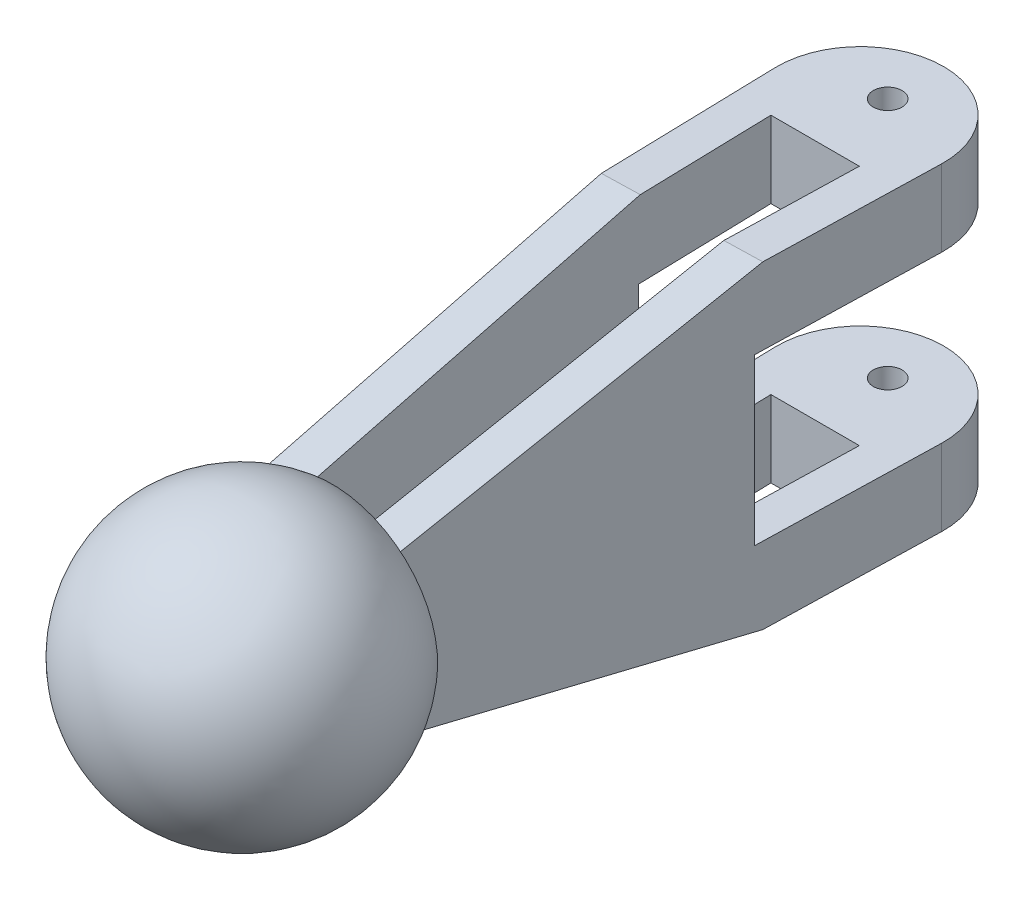
ISO-10303-21;
HEADER;
FILE_DESCRIPTION(('STEP AP214'),'2;1');
FILE_NAME('part.step','',(''),(''),'','','');
FILE_SCHEMA(('AUTOMOTIVE_DESIGN { 1 0 10303 214 1 1 1 1 }'));
ENDSEC;
DATA;
#1=APPLICATION_CONTEXT('core data for automotive mechanical design processes');
#2=APPLICATION_PROTOCOL_DEFINITION('international standard','automotive_design',2000,#1);
#3=PRODUCT_CONTEXT('',#1,'mechanical');
#4=PRODUCT('Part','Part','',(#3));
#5=PRODUCT_RELATED_PRODUCT_CATEGORY('part','',(#4));
#6=PRODUCT_DEFINITION_FORMATION('','',#4);
#7=PRODUCT_DEFINITION_CONTEXT('part definition',#1,'design');
#8=PRODUCT_DEFINITION('design','',#6,#7);
#9=PRODUCT_DEFINITION_SHAPE('','',#8);
#10=(LENGTH_UNIT() NAMED_UNIT(*) SI_UNIT(.MILLI.,.METRE.));
#11=(NAMED_UNIT(*) PLANE_ANGLE_UNIT() SI_UNIT($,.RADIAN.));
#12=(NAMED_UNIT(*) SI_UNIT($,.STERADIAN.) SOLID_ANGLE_UNIT());
#13=UNCERTAINTY_MEASURE_WITH_UNIT(LENGTH_MEASURE(1.E-05),#10,'distance_accuracy_value','');
#14=(GEOMETRIC_REPRESENTATION_CONTEXT(3) GLOBAL_UNCERTAINTY_ASSIGNED_CONTEXT((#13)) GLOBAL_UNIT_ASSIGNED_CONTEXT((#10,
#11,#12)) REPRESENTATION_CONTEXT('',''));
#15=CARTESIAN_POINT('',(0.,0.,0.));
#16=DIRECTION('',(0.,0.,1.));
#17=DIRECTION('',(1.,0.,0.));
#18=AXIS2_PLACEMENT_3D('',#15,#16,#17);
#19=CARTESIAN_POINT('',(-13.9447789910371,53.34,0.36515688895895));
#20=DIRECTION('',(0.999657324975557,0.,-0.0261769483078737));
#21=DIRECTION('',(-0.0261769483078737,0.,-0.999657324975557));
#22=AXIS2_PLACEMENT_3D('',#19,#20,#21);
#23=PLANE('',#22);
#24=DIRECTION('',(0.025542529589419,-0.218824550384705,0.975429851568582));
#25=VECTOR('',#24,1.);
#26=CARTESIAN_POINT('',(-13.907366694551,59.7130040867146,1.7938748505265));
#27=LINE('',#26,#25);
#28=CARTESIAN_POINT('',(-13.1634709791378,53.34,30.2021060998137));
#29=VERTEX_POINT('',#28);
#30=CARTESIAN_POINT('',(-11.6168505635342,40.09,89.265156888959));
#31=VERTEX_POINT('',#30);
#32=EDGE_CURVE('E237',#29,#31,#27,.T.);
#33=ORIENTED_EDGE('',*,*,#32,.F.);
#34=DIRECTION('',(0.0261769483078737,0.,0.999657324975557));
#35=VECTOR('',#34,1.);
#36=CARTESIAN_POINT('',(-13.9447789910371,53.34,0.36515688895895));
#37=LINE('',#36,#35);
#38=CARTESIAN_POINT('',(-13.9447789910371,53.34,0.36515688895895));
#39=VERTEX_POINT('',#38);
#40=EDGE_CURVE('E321',#39,#29,#37,.T.);
#41=ORIENTED_EDGE('',*,*,#40,.F.);
#42=DIRECTION('',(0.,-1.,0.));
#43=VECTOR('',#42,1.);
#44=CARTESIAN_POINT('',(-13.9447789910371,53.34,0.36515688895895));
#45=LINE('',#44,#43);
#46=CARTESIAN_POINT('',(-13.9447789910371,40.513,0.36515688895895));
#47=VERTEX_POINT('',#46);
#48=EDGE_CURVE('E341',#39,#47,#45,.T.);
#49=ORIENTED_EDGE('',*,*,#48,.T.);
#50=DIRECTION('',(0.0261769483078737,0.,0.999657324975557));
#51=VECTOR('',#50,1.);
#52=CARTESIAN_POINT('',(-13.9447789910371,40.513,0.36515688895895));
#53=LINE('',#52,#51);
#54=CARTESIAN_POINT('',(-13.1634709791378,40.513,30.2021060998137));
#55=VERTEX_POINT('',#54);
#56=EDGE_CURVE('E298',#47,#55,#53,.T.);
#57=ORIENTED_EDGE('',*,*,#56,.T.);
#58=DIRECTION('',(0.,-1.,0.));
#59=VECTOR('',#58,1.);
#60=CARTESIAN_POINT('',(-13.1634709791378,53.34,30.2021060998137));
#61=LINE('',#60,#59);
#62=CARTESIAN_POINT('',(-13.1634709791378,12.827,30.2021060998137));
#63=VERTEX_POINT('',#62);
#64=EDGE_CURVE('E308',#55,#63,#61,.T.);
#65=ORIENTED_EDGE('',*,*,#64,.T.);
#66=DIRECTION('',(-0.0261769483078737,0.,-0.999657324975557));
#67=VECTOR('',#66,1.);
#68=CARTESIAN_POINT('',(-13.9447789910371,12.827,0.36515688895895));
#69=LINE('',#68,#67);
#70=CARTESIAN_POINT('',(-13.9447789910371,12.827,0.36515688895895));
#71=VERTEX_POINT('',#70);
#72=EDGE_CURVE('E311',#63,#71,#69,.T.);
#73=ORIENTED_EDGE('',*,*,#72,.T.);
#74=CARTESIAN_POINT('',(-13.9447789910371,0.,0.36515688895895));
#75=VERTEX_POINT('',#74);
#76=EDGE_CURVE('E340',#71,#75,#45,.T.);
#77=ORIENTED_EDGE('',*,*,#76,.T.);
#78=DIRECTION('',(0.0261769483078737,0.,0.999657324975557));
#79=VECTOR('',#78,1.);
#80=CARTESIAN_POINT('',(-13.9447789910371,0.,0.36515688895895));
#81=LINE('',#80,#79);
#82=CARTESIAN_POINT('',(-13.1634709791378,0.,30.2021060998137));
#83=VERTEX_POINT('',#82);
#84=EDGE_CURVE('E330',#75,#83,#81,.T.);
#85=ORIENTED_EDGE('',*,*,#84,.T.);
#86=DIRECTION('',(0.025542529589419,0.218824550384705,0.975429851568582));
#87=VECTOR('',#86,1.);
#88=CARTESIAN_POINT('',(-13.609231696169,-3.81886172009861,13.1791911012546));
#89=LINE('',#88,#87);
#90=CARTESIAN_POINT('',(-11.6168505635363,13.25,89.265156888959));
#91=VERTEX_POINT('',#90);
#92=EDGE_CURVE('E231',#83,#91,#89,.T.);
#93=ORIENTED_EDGE('',*,*,#92,.T.);
#94=DIRECTION('',(0.,-1.,0.));
#95=VECTOR('',#94,1.);
#96=CARTESIAN_POINT('',(-11.6168505635363,53.34,89.2651568889589));
#97=LINE('',#96,#95);
#98=CARTESIAN_POINT('',(-11.6168505635363,13.4020048328163,89.2651568889589));
#99=VERTEX_POINT('',#98);
#100=EDGE_CURVE('E338',#99,#91,#97,.T.);
#101=ORIENTED_EDGE('',*,*,#100,.F.);
#102=EDGE_CURVE('E187',#31,#99,#97,.T.);
#103=ORIENTED_EDGE('',*,*,#102,.F.);
#104=EDGE_LOOP('',(#33,#41,#49,#57,#65,#73,#77,#85,#93,#101,#103));
#105=FACE_BOUND('',#104,.T.);
#106=ADVANCED_FACE('F36',(#105),#23,.F.);
#107=CARTESIAN_POINT('',(13.9447789910371,53.34,0.365156888958942));
#108=DIRECTION('',(0.999657324975557,0.,0.0261769483078731));
#109=DIRECTION('',(0.0261769483078731,0.,-0.999657324975557));
#110=AXIS2_PLACEMENT_3D('',#107,#108,#109);
#111=PLANE('',#110);
#112=DIRECTION('',(0.,1.,0.));
#113=VECTOR('',#112,1.);
#114=CARTESIAN_POINT('',(11.6327929019157,53.34,88.6563435486611));
#115=LINE('',#114,#113);
#116=CARTESIAN_POINT('',(11.6327929019157,13.25,88.6563435486611));
#117=VERTEX_POINT('',#116);
#118=CARTESIAN_POINT('',(11.6327929019157,13.4020048328163,88.6563435486611));
#119=VERTEX_POINT('',#118);
#120=EDGE_CURVE('E201',#117,#119,#115,.T.);
#121=ORIENTED_EDGE('',*,*,#120,.F.);
#122=DIRECTION('',(-0.0255442047986195,0.218538990903828,0.975493825226968));
#123=VECTOR('',#122,1.);
#124=CARTESIAN_POINT('',(13.6105615696383,-3.67045504225921,13.1284052824042));
#125=LINE('',#124,#123);
#126=CARTESIAN_POINT('',(13.1815358158548,0.,29.5122378181403));
#127=VERTEX_POINT('',#126);
#128=EDGE_CURVE('E229',#127,#117,#125,.T.);
#129=ORIENTED_EDGE('',*,*,#128,.F.);
#130=DIRECTION('',(-0.0261769483078731,0.,0.999657324975557));
#131=VECTOR('',#130,1.);
#132=CARTESIAN_POINT('',(13.9447789910371,0.,0.365156888958942));
#133=LINE('',#132,#131);
#134=CARTESIAN_POINT('',(13.9447789910371,0.,0.365156888958942));
#135=VERTEX_POINT('',#134);
#136=EDGE_CURVE('E322',#135,#127,#133,.T.);
#137=ORIENTED_EDGE('',*,*,#136,.F.);
#138=DIRECTION('',(0.,-1.,0.));
#139=VECTOR('',#138,1.);
#140=CARTESIAN_POINT('',(13.9447789910371,53.34,0.365156888958942));
#141=LINE('',#140,#139);
#142=CARTESIAN_POINT('',(13.9447789910371,12.827,0.365156888958943));
#143=VERTEX_POINT('',#142);
#144=EDGE_CURVE('E327',#143,#135,#141,.T.);
#145=ORIENTED_EDGE('',*,*,#144,.F.);
#146=DIRECTION('',(0.0261769483078731,0.,-0.999657324975557));
#147=VECTOR('',#146,1.);
#148=CARTESIAN_POINT('',(13.1454308996518,12.827,30.8910289409831));
#149=LINE('',#148,#147);
#150=CARTESIAN_POINT('',(13.1454308996518,12.827,30.8910289409831));
#151=VERTEX_POINT('',#150);
#152=EDGE_CURVE('E292',#151,#143,#149,.T.);
#153=ORIENTED_EDGE('',*,*,#152,.F.);
#154=DIRECTION('',(0.,-1.,0.));
#155=VECTOR('',#154,1.);
#156=CARTESIAN_POINT('',(13.1454308996518,12.827,30.8910289409831));
#157=LINE('',#156,#155);
#158=CARTESIAN_POINT('',(13.1454308996518,40.513,30.8910289409831));
#159=VERTEX_POINT('',#158);
#160=EDGE_CURVE('E289',#159,#151,#157,.T.);
#161=ORIENTED_EDGE('',*,*,#160,.F.);
#162=DIRECTION('',(-0.0261769483078731,0.,0.999657324975557));
#163=VECTOR('',#162,1.);
#164=CARTESIAN_POINT('',(13.9447789910371,40.513,0.365156888958942));
#165=LINE('',#164,#163);
#166=CARTESIAN_POINT('',(13.9447789910371,40.513,0.365156888958942));
#167=VERTEX_POINT('',#166);
#168=EDGE_CURVE('E344',#167,#159,#165,.T.);
#169=ORIENTED_EDGE('',*,*,#168,.F.);
#170=CARTESIAN_POINT('',(13.9447789910371,53.34,0.365156888958942));
#171=VERTEX_POINT('',#170);
#172=EDGE_CURVE('E335',#171,#167,#141,.T.);
#173=ORIENTED_EDGE('',*,*,#172,.F.);
#174=DIRECTION('',(-0.0261769483078731,0.,0.999657324975557));
#175=VECTOR('',#174,1.);
#176=CARTESIAN_POINT('',(13.9447789910371,53.34,0.365156888958942));
#177=LINE('',#176,#175);
#178=CARTESIAN_POINT('',(13.1815358158548,53.34,29.5122378181403));
#179=VERTEX_POINT('',#178);
#180=EDGE_CURVE('E325',#171,#179,#177,.T.);
#181=ORIENTED_EDGE('',*,*,#180,.T.);
#182=DIRECTION('',(-0.0255442047986195,-0.218538990903828,0.975493825226968));
#183=VECTOR('',#182,1.);
#184=CARTESIAN_POINT('',(13.9083270384769,59.5579355999436,1.75720079560202));
#185=LINE('',#184,#183);
#186=CARTESIAN_POINT('',(11.6327929019157,40.09,88.6563435486611));
#187=VERTEX_POINT('',#186);
#188=EDGE_CURVE('E204',#179,#187,#185,.T.);
#189=ORIENTED_EDGE('',*,*,#188,.T.);
#190=EDGE_CURVE('E184',#119,#187,#115,.T.);
#191=ORIENTED_EDGE('',*,*,#190,.F.);
#192=EDGE_LOOP('',(#121,#129,#137,#145,#153,#161,#169,#173,#181,#189,#191));
#193=FACE_BOUND('',#192,.T.);
#194=ADVANCED_FACE('F199',(#193),#111,.T.);
#195=CARTESIAN_POINT('',(0.,53.34,0.));
#196=DIRECTION('',(0.,1.,0.));
#197=DIRECTION('',(0.,0.,1.));
#198=AXIS2_PLACEMENT_3D('',#195,#196,#197);
#199=PLANE('',#198);
#200=CARTESIAN_POINT('',(0.,53.34,-4.57874024016128));
#201=DIRECTION('',(0.,1.,0.));
#202=DIRECTION('',(0.,0.,1.));
#203=AXIS2_PLACEMENT_3D('',#200,#201,#202);
#204=CIRCLE('',#203,2.413);
#205=CARTESIAN_POINT('',(0.,53.34,-2.16574024016128));
#206=VERTEX_POINT('',#205);
#207=EDGE_CURVE('E240',#206,#206,#204,.T.);
#208=ORIENTED_EDGE('',*,*,#207,.F.);
#209=EDGE_LOOP('',(#208));
#210=FACE_BOUND('',#209,.T.);
#211=ORIENTED_EDGE('',*,*,#40,.T.);
#212=DIRECTION('',(0.999657324975557,0.,-0.0261769483078737));
#213=VECTOR('',#212,1.);
#214=CARTESIAN_POINT('',(-113.129203476694,53.34,32.819800930601));
#215=LINE('',#214,#213);
#216=CARTESIAN_POINT('',(-6.81564696554305,53.34,30.0358824780587));
#217=VERTEX_POINT('',#216);
#218=EDGE_CURVE('E225',#29,#217,#215,.T.);
#219=ORIENTED_EDGE('',*,*,#218,.T.);
#220=DIRECTION('',(0.0261769483078736,0.,0.999657324975557));
#221=VECTOR('',#220,1.);
#222=CARTESIAN_POINT('',(-5.21373558662709,53.34,91.2104099692313));
#223=LINE('',#222,#221);
#224=CARTESIAN_POINT('',(-7.40397755307151,53.34,7.5684437830325));
#225=VERTEX_POINT('',#224);
#226=EDGE_CURVE('E254',#225,#217,#223,.T.);
#227=ORIENTED_EDGE('',*,*,#226,.F.);
#228=DIRECTION('',(-1.,0.,0.));
#229=VECTOR('',#228,1.);
#230=CARTESIAN_POINT('',(7.40397755307151,53.34,7.5684437830325));
#231=LINE('',#230,#229);
#232=CARTESIAN_POINT('',(7.40397755307151,53.34,7.5684437830325));
#233=VERTEX_POINT('',#232);
#234=EDGE_CURVE('E262',#233,#225,#231,.T.);
#235=ORIENTED_EDGE('',*,*,#234,.F.);
#236=DIRECTION('',(0.0261769483078731,0.,-0.999657324975557));
#237=VECTOR('',#236,1.);
#238=CARTESIAN_POINT('',(7.40397755307151,53.34,7.5684437830325));
#239=LINE('',#238,#237);
#240=CARTESIAN_POINT('',(6.82500039137944,53.34,29.6786895562174));
#241=VERTEX_POINT('',#240);
#242=EDGE_CURVE('E250',#241,#233,#239,.T.);
#243=ORIENTED_EDGE('',*,*,#242,.F.);
#244=EDGE_CURVE('E222',#241,#179,#215,.T.);
#245=ORIENTED_EDGE('',*,*,#244,.T.);
#246=ORIENTED_EDGE('',*,*,#180,.F.);
#247=CARTESIAN_POINT('',(0.,53.34,0.));
#248=DIRECTION('',(0.,1.,0.));
#249=DIRECTION('',(0.,0.,1.));
#250=AXIS2_PLACEMENT_3D('',#247,#248,#249);
#251=CIRCLE('',#250,13.949559156562);
#252=EDGE_CURVE('E318',#171,#39,#251,.T.);
#253=ORIENTED_EDGE('',*,*,#252,.T.);
#254=EDGE_LOOP('',(#211,#219,#227,#235,#243,#245,#246,#253));
#255=FACE_BOUND('',#254,.T.);
#256=ADVANCED_FACE('F371',(#210,#255),#199,.T.);
#257=CARTESIAN_POINT('',(-5.21373558662709,0.,91.2104099692313));
#258=DIRECTION('',(-0.999657324975557,0.,0.0261769483078736));
#259=DIRECTION('',(0.0261769483078736,0.,0.999657324975557));
#260=AXIS2_PLACEMENT_3D('',#257,#258,#259);
#261=PLANE('',#260);
#262=DIRECTION('',(-0.0255425295894189,0.218824550384705,-0.975429851568582));
#263=VECTOR('',#262,1.);
#264=CARTESIAN_POINT('',(-4.99230680722626,37.7193235534773,99.6664338985698));
#265=LINE('',#264,#263);
#266=CARTESIAN_POINT('',(-5.26902654994155,40.09,89.098933267204));
#267=VERTEX_POINT('',#266);
#268=EDGE_CURVE('E234',#267,#217,#265,.T.);
#269=ORIENTED_EDGE('',*,*,#268,.F.);
#270=DIRECTION('',(0.,-1.,0.));
#271=VECTOR('',#270,1.);
#272=CARTESIAN_POINT('',(-5.26902654994154,0.,89.098933267204));
#273=LINE('',#272,#271);
#274=CARTESIAN_POINT('',(-5.26902654994154,13.25,89.098933267204));
#275=VERTEX_POINT('',#274);
#276=EDGE_CURVE('E195',#267,#275,#273,.T.);
#277=ORIENTED_EDGE('',*,*,#276,.T.);
#278=DIRECTION('',(-0.0255425295894189,-0.218824550384705,-0.975429851568582));
#279=VECTOR('',#278,1.);
#280=CARTESIAN_POINT('',(-5.29044180560822,13.0665340799067,88.2811176478417));
#281=LINE('',#280,#279);
#282=CARTESIAN_POINT('',(-6.81564696554303,0.,30.0358824780587));
#283=VERTEX_POINT('',#282);
#284=EDGE_CURVE('E226',#275,#283,#281,.T.);
#285=ORIENTED_EDGE('',*,*,#284,.T.);
#286=DIRECTION('',(0.0261769483078736,0.,0.999657324975557));
#287=VECTOR('',#286,1.);
#288=CARTESIAN_POINT('',(-5.21373558662709,0.,91.2104099692313));
#289=LINE('',#288,#287);
#290=CARTESIAN_POINT('',(-7.40397755307151,0.,7.5684437830325));
#291=VERTEX_POINT('',#290);
#292=EDGE_CURVE('E257',#291,#283,#289,.T.);
#293=ORIENTED_EDGE('',*,*,#292,.F.);
#294=DIRECTION('',(0.,1.,0.));
#295=VECTOR('',#294,1.);
#296=CARTESIAN_POINT('',(-7.40397755307151,0.,7.5684437830325));
#297=LINE('',#296,#295);
#298=CARTESIAN_POINT('',(-7.40397755307151,12.827,7.5684437830325));
#299=VERTEX_POINT('',#298);
#300=EDGE_CURVE('E267',#291,#299,#297,.T.);
#301=ORIENTED_EDGE('',*,*,#300,.T.);
#302=DIRECTION('',(-0.0261769483078736,0.,-0.999657324975557));
#303=VECTOR('',#302,1.);
#304=CARTESIAN_POINT('',(-6.81830691433065,12.827,29.9343031320507));
#305=LINE('',#304,#303);
#306=CARTESIAN_POINT('',(-6.80693555466247,12.827,30.3685578378907));
#307=VERTEX_POINT('',#306);
#308=EDGE_CURVE('E286',#307,#299,#305,.T.);
#309=ORIENTED_EDGE('',*,*,#308,.F.);
#310=DIRECTION('',(0.,-1.,0.));
#311=VECTOR('',#310,1.);
#312=CARTESIAN_POINT('',(-6.80693555466247,12.827,30.3685578378907));
#313=LINE('',#312,#311);
#314=CARTESIAN_POINT('',(-6.80693555466247,40.513,30.3685578378907));
#315=VERTEX_POINT('',#314);
#316=EDGE_CURVE('E283',#315,#307,#313,.T.);
#317=ORIENTED_EDGE('',*,*,#316,.F.);
#318=DIRECTION('',(0.0261769483078736,0.,0.999657324975557));
#319=VECTOR('',#318,1.);
#320=CARTESIAN_POINT('',(-6.81830691433065,40.513,29.9343031320507));
#321=LINE('',#320,#319);
#322=CARTESIAN_POINT('',(-7.40397755307151,40.513,7.5684437830325));
#323=VERTEX_POINT('',#322);
#324=EDGE_CURVE('E353',#323,#315,#321,.T.);
#325=ORIENTED_EDGE('',*,*,#324,.F.);
#326=EDGE_CURVE('E271',#323,#225,#297,.T.);
#327=ORIENTED_EDGE('',*,*,#326,.T.);
#328=ORIENTED_EDGE('',*,*,#226,.T.);
#329=EDGE_LOOP('',(#269,#277,#285,#293,#301,#309,#317,#325,#327,#328));
#330=FACE_BOUND('',#329,.T.);
#331=ADVANCED_FACE('F424',(#330),#261,.F.);
#332=CARTESIAN_POINT('',(7.40397755307151,0.,7.5684437830325));
#333=DIRECTION('',(0.999657324975557,0.,0.0261769483078731));
#334=DIRECTION('',(0.0261769483078731,0.,-0.999657324975557));
#335=AXIS2_PLACEMENT_3D('',#332,#333,#334);
#336=PLANE('',#335);
#337=DIRECTION('',(-0.0255442047986195,0.218538990903828,0.975493825226968));
#338=VECTOR('',#337,1.);
#339=CARTESIAN_POINT('',(7.37632601458719,-4.71677025396209,8.62441343494122));
#340=LINE('',#339,#338);
#341=CARTESIAN_POINT('',(6.82500039137944,0.,29.6786895562174));
#342=VERTEX_POINT('',#341);
#343=CARTESIAN_POINT('',(5.27625747744033,13.25,88.8227952867382));
#344=VERTEX_POINT('',#343);
#345=EDGE_CURVE('E356',#342,#344,#340,.T.);
#346=ORIENTED_EDGE('',*,*,#345,.T.);
#347=DIRECTION('',(0.,1.,0.));
#348=VECTOR('',#347,1.);
#349=CARTESIAN_POINT('',(5.27625747744033,0.,88.8227952867381));
#350=LINE('',#349,#348);
#351=CARTESIAN_POINT('',(5.27625747744033,40.09,88.8227952867382));
#352=VERTEX_POINT('',#351);
#353=EDGE_CURVE('E205',#344,#352,#350,.T.);
#354=ORIENTED_EDGE('',*,*,#353,.T.);
#355=DIRECTION('',(-0.0255442047986195,-0.218538990903828,0.975493825226968));
#356=VECTOR('',#355,1.);
#357=CARTESIAN_POINT('',(7.0785605457486,55.5092896962777,19.9956179217434));
#358=LINE('',#357,#356);
#359=EDGE_CURVE('E44',#241,#352,#358,.T.);
#360=ORIENTED_EDGE('',*,*,#359,.F.);
#361=ORIENTED_EDGE('',*,*,#242,.T.);
#362=DIRECTION('',(0.,1.,0.));
#363=VECTOR('',#362,1.);
#364=CARTESIAN_POINT('',(7.40397755307151,0.,7.5684437830325));
#365=LINE('',#364,#363);
#366=CARTESIAN_POINT('',(7.40397755307152,40.513,7.5684437830325));
#367=VERTEX_POINT('',#366);
#368=EDGE_CURVE('E260',#367,#233,#365,.T.);
#369=ORIENTED_EDGE('',*,*,#368,.F.);
#370=DIRECTION('',(0.0261769483078731,0.,-0.999657324975557));
#371=VECTOR('',#370,1.);
#372=CARTESIAN_POINT('',(6.79760688605696,40.513,30.7248053192281));
#373=LINE('',#372,#371);
#374=CARTESIAN_POINT('',(6.79760688605696,40.513,30.7248053192281));
#375=VERTEX_POINT('',#374);
#376=EDGE_CURVE('E347',#375,#367,#373,.T.);
#377=ORIENTED_EDGE('',*,*,#376,.F.);
#378=DIRECTION('',(0.,1.,0.));
#379=VECTOR('',#378,1.);
#380=CARTESIAN_POINT('',(6.79760688605696,12.827,30.7248053192281));
#381=LINE('',#380,#379);
#382=CARTESIAN_POINT('',(6.79760688605696,12.827,30.7248053192281));
#383=VERTEX_POINT('',#382);
#384=EDGE_CURVE('E270',#383,#375,#381,.T.);
#385=ORIENTED_EDGE('',*,*,#384,.F.);
#386=DIRECTION('',(-0.0261769483078731,0.,0.999657324975557));
#387=VECTOR('',#386,1.);
#388=CARTESIAN_POINT('',(6.79760688605696,12.827,30.7248053192281));
#389=LINE('',#388,#387);
#390=CARTESIAN_POINT('',(7.40397755307151,12.827,7.5684437830325));
#391=VERTEX_POINT('',#390);
#392=EDGE_CURVE('E277',#391,#383,#389,.T.);
#393=ORIENTED_EDGE('',*,*,#392,.F.);
#394=CARTESIAN_POINT('',(7.40397755307151,0.,7.5684437830325));
#395=VERTEX_POINT('',#394);
#396=EDGE_CURVE('E272',#395,#391,#365,.T.);
#397=ORIENTED_EDGE('',*,*,#396,.F.);
#398=DIRECTION('',(0.0261769483078731,0.,-0.999657324975557));
#399=VECTOR('',#398,1.);
#400=CARTESIAN_POINT('',(7.40397755307151,0.,7.5684437830325));
#401=LINE('',#400,#399);
#402=EDGE_CURVE('E251',#342,#395,#401,.T.);
#403=ORIENTED_EDGE('',*,*,#402,.F.);
#404=EDGE_LOOP('',(#346,#354,#360,#361,#369,#377,#385,#393,#397,#403));
#405=FACE_BOUND('',#404,.T.);
#406=ADVANCED_FACE('F367',(#405),#336,.F.);
#407=CARTESIAN_POINT('',(-15.1043803137539,12.827,30.1512816002045));
#408=DIRECTION('',(-0.0261769483078731,0.,0.999657324975557));
#409=DIRECTION('',(0.999657324975557,0.,0.0261769483078731));
#410=AXIS2_PLACEMENT_3D('',#407,#408,#409);
#411=PLANE('',#410);
#412=DIRECTION('',(0.999657324975557,0.,0.0261769483078731));
#413=VECTOR('',#412,1.);
#414=CARTESIAN_POINT('',(-15.1043803137539,40.513,30.1512816002045));
#415=LINE('',#414,#413);
#416=EDGE_CURVE('E300',#55,#315,#415,.T.);
#417=ORIENTED_EDGE('',*,*,#416,.T.);
#418=ORIENTED_EDGE('',*,*,#316,.T.);
#419=DIRECTION('',(0.999657324975557,0.,0.0261769483078731));
#420=VECTOR('',#419,1.);
#421=CARTESIAN_POINT('',(-15.1043803137539,12.827,30.1512816002045));
#422=LINE('',#421,#420);
#423=EDGE_CURVE('E295',#63,#307,#422,.T.);
#424=ORIENTED_EDGE('',*,*,#423,.F.);
#425=ORIENTED_EDGE('',*,*,#64,.F.);
#426=EDGE_LOOP('',(#417,#418,#424,#425));
#427=FACE_BOUND('',#426,.T.);
#428=ADVANCED_FACE('F420',(#427),#411,.F.);
#429=CARTESIAN_POINT('',(0.,53.34,0.));
#430=DIRECTION('',(0.,-1.,0.));
#431=DIRECTION('',(0.,0.,-1.));
#432=AXIS2_PLACEMENT_3D('',#429,#430,#431);
#433=CYLINDRICAL_SURFACE('',#432,13.949559156562);
#434=ORIENTED_EDGE('',*,*,#76,.F.);
#435=CARTESIAN_POINT('',(0.,12.827,0.));
#436=DIRECTION('',(0.,-1.,0.));
#437=DIRECTION('',(0.,0.,-1.));
#438=AXIS2_PLACEMENT_3D('',#435,#436,#437);
#439=CIRCLE('',#438,13.949559156562);
#440=EDGE_CURVE('E314',#71,#143,#439,.T.);
#441=ORIENTED_EDGE('',*,*,#440,.T.);
#442=ORIENTED_EDGE('',*,*,#144,.T.);
#443=CARTESIAN_POINT('',(0.,0.,0.));
#444=DIRECTION('',(0.,1.,0.));
#445=DIRECTION('',(0.,0.,1.));
#446=AXIS2_PLACEMENT_3D('',#443,#444,#445);
#447=CIRCLE('',#446,13.949559156562);
#448=EDGE_CURVE('E317',#135,#75,#447,.T.);
#449=ORIENTED_EDGE('',*,*,#448,.T.);
#450=EDGE_LOOP('',(#434,#441,#442,#449));
#451=FACE_BOUND('',#450,.T.);
#452=ADVANCED_FACE('F394',(#451),#433,.T.);
#453=ORIENTED_EDGE('',*,*,#172,.T.);
#454=CARTESIAN_POINT('',(0.,40.513,0.));
#455=DIRECTION('',(0.,1.,0.));
#456=DIRECTION('',(0.,0.,1.));
#457=AXIS2_PLACEMENT_3D('',#454,#455,#456);
#458=CIRCLE('',#457,13.949559156562);
#459=EDGE_CURVE('E305',#167,#47,#458,.T.);
#460=ORIENTED_EDGE('',*,*,#459,.T.);
#461=ORIENTED_EDGE('',*,*,#48,.F.);
#462=ORIENTED_EDGE('',*,*,#252,.F.);
#463=EDGE_LOOP('',(#453,#460,#461,#462));
#464=FACE_BOUND('',#463,.T.);
#465=ADVANCED_FACE('F38',(#464),#433,.T.);
#466=CARTESIAN_POINT('',(0.,0.,0.));
#467=DIRECTION('',(0.,1.,0.));
#468=DIRECTION('',(0.,0.,1.));
#469=AXIS2_PLACEMENT_3D('',#466,#467,#468);
#470=PLANE('',#469);
#471=CARTESIAN_POINT('',(0.,0.,-4.57874024016128));
#472=DIRECTION('',(0.,1.,0.));
#473=DIRECTION('',(0.,0.,1.));
#474=AXIS2_PLACEMENT_3D('',#471,#472,#473);
#475=CIRCLE('',#474,2.413);
#476=CARTESIAN_POINT('',(0.,0.,-2.16574024016128));
#477=VERTEX_POINT('',#476);
#478=EDGE_CURVE('E241',#477,#477,#475,.T.);
#479=ORIENTED_EDGE('',*,*,#478,.T.);
#480=EDGE_LOOP('',(#479));
#481=FACE_BOUND('',#480,.T.);
#482=ORIENTED_EDGE('',*,*,#136,.T.);
#483=DIRECTION('',(0.999657324975557,0.,-0.0261769483078737));
#484=VECTOR('',#483,1.);
#485=CARTESIAN_POINT('',(-113.129203476694,0.,32.819800930601));
#486=LINE('',#485,#484);
#487=EDGE_CURVE('E209',#342,#127,#486,.T.);
#488=ORIENTED_EDGE('',*,*,#487,.F.);
#489=ORIENTED_EDGE('',*,*,#402,.T.);
#490=DIRECTION('',(-1.,0.,0.));
#491=VECTOR('',#490,1.);
#492=CARTESIAN_POINT('',(7.40397755307151,0.,7.5684437830325));
#493=LINE('',#492,#491);
#494=EDGE_CURVE('E253',#395,#291,#493,.T.);
#495=ORIENTED_EDGE('',*,*,#494,.T.);
#496=ORIENTED_EDGE('',*,*,#292,.T.);
#497=EDGE_CURVE('E210',#83,#283,#486,.T.);
#498=ORIENTED_EDGE('',*,*,#497,.F.);
#499=ORIENTED_EDGE('',*,*,#84,.F.);
#500=ORIENTED_EDGE('',*,*,#448,.F.);
#501=EDGE_LOOP('',(#482,#488,#489,#495,#496,#498,#499,#500));
#502=FACE_BOUND('',#501,.T.);
#503=ADVANCED_FACE('F401',(#481,#502),#470,.F.);
#504=CARTESIAN_POINT('',(-15.1043803137539,12.827,30.1512816002045));
#505=DIRECTION('',(0.,-1.,0.));
#506=DIRECTION('',(0.,0.,-1.));
#507=AXIS2_PLACEMENT_3D('',#504,#505,#506);
#508=PLANE('',#507);
#509=CARTESIAN_POINT('',(0.,12.827,-4.57874024016128));
#510=DIRECTION('',(0.,-1.,0.));
#511=DIRECTION('',(0.,0.,-1.));
#512=AXIS2_PLACEMENT_3D('',#509,#510,#511);
#513=CIRCLE('',#512,2.413);
#514=CARTESIAN_POINT('',(0.,12.827,-6.99174024016128));
#515=VERTEX_POINT('',#514);
#516=EDGE_CURVE('E247',#515,#515,#513,.T.);
#517=ORIENTED_EDGE('',*,*,#516,.T.);
#518=EDGE_LOOP('',(#517));
#519=FACE_BOUND('',#518,.T.);
#520=ORIENTED_EDGE('',*,*,#423,.T.);
#521=ORIENTED_EDGE('',*,*,#308,.T.);
#522=DIRECTION('',(1.,0.,0.));
#523=VECTOR('',#522,1.);
#524=CARTESIAN_POINT('',(-15.1043803137539,12.827,7.56844378303249));
#525=LINE('',#524,#523);
#526=EDGE_CURVE('E280',#299,#391,#525,.T.);
#527=ORIENTED_EDGE('',*,*,#526,.T.);
#528=ORIENTED_EDGE('',*,*,#392,.T.);
#529=EDGE_CURVE('E299',#383,#151,#422,.T.);
#530=ORIENTED_EDGE('',*,*,#529,.T.);
#531=ORIENTED_EDGE('',*,*,#152,.T.);
#532=ORIENTED_EDGE('',*,*,#440,.F.);
#533=ORIENTED_EDGE('',*,*,#72,.F.);
#534=EDGE_LOOP('',(#520,#521,#527,#528,#530,#531,#532,#533));
#535=FACE_BOUND('',#534,.T.);
#536=ADVANCED_FACE('F391',(#519,#535),#508,.F.);
#537=ORIENTED_EDGE('',*,*,#529,.F.);
#538=ORIENTED_EDGE('',*,*,#384,.T.);
#539=EDGE_CURVE('E294',#375,#159,#415,.T.);
#540=ORIENTED_EDGE('',*,*,#539,.T.);
#541=ORIENTED_EDGE('',*,*,#160,.T.);
#542=EDGE_LOOP('',(#537,#538,#540,#541));
#543=FACE_BOUND('',#542,.T.);
#544=ADVANCED_FACE('F383',(#543),#411,.F.);
#545=CARTESIAN_POINT('',(-15.1043803137539,40.513,30.1512816002045));
#546=DIRECTION('',(0.,1.,0.));
#547=DIRECTION('',(0.,0.,1.));
#548=AXIS2_PLACEMENT_3D('',#545,#546,#547);
#549=PLANE('',#548);
#550=CARTESIAN_POINT('',(0.,40.513,-4.57874024016128));
#551=DIRECTION('',(0.,1.,0.));
#552=DIRECTION('',(0.,0.,1.));
#553=AXIS2_PLACEMENT_3D('',#550,#551,#552);
#554=CIRCLE('',#553,2.413);
#555=CARTESIAN_POINT('',(0.,40.513,-2.16574024016128));
#556=VERTEX_POINT('',#555);
#557=EDGE_CURVE('E244',#556,#556,#554,.T.);
#558=ORIENTED_EDGE('',*,*,#557,.T.);
#559=EDGE_LOOP('',(#558));
#560=FACE_BOUND('',#559,.T.);
#561=DIRECTION('',(-1.,0.,0.));
#562=VECTOR('',#561,1.);
#563=CARTESIAN_POINT('',(-15.1043803137539,40.513,7.56844378303249));
#564=LINE('',#563,#562);
#565=EDGE_CURVE('E350',#367,#323,#564,.T.);
#566=ORIENTED_EDGE('',*,*,#565,.T.);
#567=ORIENTED_EDGE('',*,*,#324,.T.);
#568=ORIENTED_EDGE('',*,*,#416,.F.);
#569=ORIENTED_EDGE('',*,*,#56,.F.);
#570=ORIENTED_EDGE('',*,*,#459,.F.);
#571=ORIENTED_EDGE('',*,*,#168,.T.);
#572=ORIENTED_EDGE('',*,*,#539,.F.);
#573=ORIENTED_EDGE('',*,*,#376,.T.);
#574=EDGE_LOOP('',(#566,#567,#568,#569,#570,#571,#572,#573));
#575=FACE_BOUND('',#574,.T.);
#576=ADVANCED_FACE('F384',(#560,#575),#549,.F.);
#577=CARTESIAN_POINT('',(7.40397755307151,0.,7.5684437830325));
#578=DIRECTION('',(0.,0.,-1.));
#579=DIRECTION('',(-1.,0.,0.));
#580=AXIS2_PLACEMENT_3D('',#577,#578,#579);
#581=PLANE('',#580);
#582=ORIENTED_EDGE('',*,*,#300,.F.);
#583=ORIENTED_EDGE('',*,*,#494,.F.);
#584=ORIENTED_EDGE('',*,*,#396,.T.);
#585=ORIENTED_EDGE('',*,*,#526,.F.);
#586=EDGE_LOOP('',(#582,#583,#584,#585));
#587=FACE_BOUND('',#586,.T.);
#588=ADVANCED_FACE('F427',(#587),#581,.F.);
#589=ORIENTED_EDGE('',*,*,#368,.T.);
#590=ORIENTED_EDGE('',*,*,#234,.T.);
#591=ORIENTED_EDGE('',*,*,#326,.F.);
#592=ORIENTED_EDGE('',*,*,#565,.F.);
#593=EDGE_LOOP('',(#589,#590,#591,#592));
#594=FACE_BOUND('',#593,.T.);
#595=ADVANCED_FACE('F377',(#594),#581,.F.);
#596=CARTESIAN_POINT('',(0.,0.,-4.57874024016128));
#597=DIRECTION('',(0.,1.,0.));
#598=DIRECTION('',(0.,0.,1.));
#599=AXIS2_PLACEMENT_3D('',#596,#597,#598);
#600=CYLINDRICAL_SURFACE('',#599,2.413);
#601=ORIENTED_EDGE('',*,*,#207,.T.);
#602=EDGE_LOOP('',(#601));
#603=FACE_BOUND('',#602,.T.);
#604=ORIENTED_EDGE('',*,*,#557,.F.);
#605=EDGE_LOOP('',(#604));
#606=FACE_BOUND('',#605,.T.);
#607=ADVANCED_FACE('F470',(#603,#606),#600,.F.);
#608=ORIENTED_EDGE('',*,*,#478,.F.);
#609=EDGE_LOOP('',(#608));
#610=FACE_BOUND('',#609,.T.);
#611=ORIENTED_EDGE('',*,*,#516,.F.);
#612=EDGE_LOOP('',(#611));
#613=FACE_BOUND('',#612,.T.);
#614=ADVANCED_FACE('F468',(#610,#613),#600,.F.);
#615=CARTESIAN_POINT('',(-113.873099192107,-6.3730040867146,4.41156968131387));
#616=DIRECTION('',(-0.00572815894391412,0.975764221597068,-0.218749564676553));
#617=DIRECTION('',(0.,0.218753153548889,0.975780230283652));
#618=AXIS2_PLACEMENT_3D('',#615,#616,#617);
#619=PLANE('',#618);
#620=ORIENTED_EDGE('',*,*,#128,.T.);
#621=DIRECTION('',(0.999657324975557,0.,-0.0261769483078737));
#622=VECTOR('',#621,1.);
#623=CARTESIAN_POINT('',(-111.582583061092,13.25,91.8828517197463));
#624=LINE('',#623,#622);
#625=CARTESIAN_POINT('',(11.4557556569433,13.25,88.6609794320727));
#626=VERTEX_POINT('',#625);
#627=EDGE_CURVE('E208',#626,#117,#624,.T.);
#628=ORIENTED_EDGE('',*,*,#627,.F.);
#629=EDGE_CURVE('E215',#344,#626,#624,.T.);
#630=ORIENTED_EDGE('',*,*,#629,.F.);
#631=ORIENTED_EDGE('',*,*,#345,.F.);
#632=ORIENTED_EDGE('',*,*,#487,.T.);
#633=EDGE_LOOP('',(#620,#628,#630,#631,#632));
#634=FACE_BOUND('',#633,.T.);
#635=ADVANCED_FACE('F432',(#634),#619,.F.);
#636=ORIENTED_EDGE('',*,*,#497,.T.);
#637=ORIENTED_EDGE('',*,*,#284,.F.);
#638=CARTESIAN_POINT('',(-11.439813318564,13.2499999999999,89.2605210055474));
#639=VERTEX_POINT('',#638);
#640=EDGE_CURVE('E217',#639,#275,#624,.T.);
#641=ORIENTED_EDGE('',*,*,#640,.F.);
#642=EDGE_CURVE('E218',#91,#639,#624,.T.);
#643=ORIENTED_EDGE('',*,*,#642,.F.);
#644=ORIENTED_EDGE('',*,*,#92,.F.);
#645=EDGE_LOOP('',(#636,#637,#641,#643,#644));
#646=FACE_BOUND('',#645,.T.);
#647=ADVANCED_FACE('F412',(#646),#619,.F.);
#648=CARTESIAN_POINT('',(-113.574964193725,57.1588617200986,15.796885932042));
#649=DIRECTION('',(0.00572815894391412,0.975764221597068,0.218749564676553));
#650=DIRECTION('',(0.,-0.218753153548889,0.975780230283651));
#651=AXIS2_PLACEMENT_3D('',#648,#649,#650);
#652=PLANE('',#651);
#653=ORIENTED_EDGE('',*,*,#32,.T.);
#654=DIRECTION('',(0.999657324975557,0.,-0.0261769483078737));
#655=VECTOR('',#654,1.);
#656=CARTESIAN_POINT('',(-111.582583061092,40.09,91.8828517197463));
#657=LINE('',#656,#655);
#658=EDGE_CURVE('E221',#31,#267,#657,.T.);
#659=ORIENTED_EDGE('',*,*,#658,.T.);
#660=ORIENTED_EDGE('',*,*,#268,.T.);
#661=ORIENTED_EDGE('',*,*,#218,.F.);
#662=EDGE_LOOP('',(#653,#659,#660,#661));
#663=FACE_BOUND('',#662,.T.);
#664=ADVANCED_FACE('F434',(#663),#652,.T.);
#665=ORIENTED_EDGE('',*,*,#244,.F.);
#666=ORIENTED_EDGE('',*,*,#359,.T.);
#667=EDGE_CURVE('E219',#352,#187,#657,.T.);
#668=ORIENTED_EDGE('',*,*,#667,.T.);
#669=ORIENTED_EDGE('',*,*,#188,.F.);
#670=EDGE_LOOP('',(#665,#666,#668,#669));
#671=FACE_BOUND('',#670,.T.);
#672=ADVANCED_FACE('F363',(#671),#652,.T.);
#673=CARTESIAN_POINT('',(-11.6168505635363,-59.91,89.265156888959));
#674=DIRECTION('',(-0.0261769483078736,0.,-0.999657324975557));
#675=DIRECTION('',(-0.999657324975557,0.,0.0261769483078736));
#676=AXIS2_PLACEMENT_3D('',#673,#674,#675);
#677=PLANE('',#676);
#678=ORIENTED_EDGE('',*,*,#120,.T.);
#679=CARTESIAN_POINT('',(0.00797116918966879,26.7713365552108,88.9607502188101));
#680=DIRECTION('',(-0.0261769483078744,0.,-0.999657324975557));
#681=DIRECTION('',(-0.999657324975557,0.,0.0261769483078744));
#682=AXIS2_PLACEMENT_3D('',#679,#680,#681);
#683=CIRCLE('',#682,17.7191471138403);
#684=EDGE_CURVE('E189',#119,#626,#683,.T.);
#685=ORIENTED_EDGE('',*,*,#684,.T.);
#686=ORIENTED_EDGE('',*,*,#627,.T.);
#687=EDGE_LOOP('',(#678,#685,#686));
#688=FACE_BOUND('',#687,.T.);
#689=ADVANCED_FACE('F207',(#688),#677,.F.);
#690=ORIENTED_EDGE('',*,*,#642,.T.);
#691=CARTESIAN_POINT('',(0.00797116918967866,26.7713365552108,88.96075021881));
#692=DIRECTION('',(-0.0261769483078736,0.,-0.999657324975557));
#693=DIRECTION('',(-0.999657324975557,0.,0.0261769483078736));
#694=AXIS2_PLACEMENT_3D('',#691,#692,#693);
#695=CIRCLE('',#694,17.7191471138403);
#696=EDGE_CURVE('E12',#639,#99,#695,.T.);
#697=ORIENTED_EDGE('',*,*,#696,.T.);
#698=ORIENTED_EDGE('',*,*,#100,.T.);
#699=EDGE_LOOP('',(#690,#697,#698));
#700=FACE_BOUND('',#699,.T.);
#701=ADVANCED_FACE('F410',(#700),#677,.F.);
#702=CARTESIAN_POINT('',(2.32792842750077,26.7713365552108,88.9000000000001));
#703=DIRECTION('',(0.0261769483078744,0.,0.999657324975557));
#704=DIRECTION('',(0.999657324975557,0.,-0.0261769483078744));
#705=AXIS2_PLACEMENT_3D('',#702,#703,#704);
#706=PLANE('',#705);
#707=EDGE_CURVE('E51',#626,#639,#683,.T.);
#708=ORIENTED_EDGE('',*,*,#707,.T.);
#709=ORIENTED_EDGE('',*,*,#640,.T.);
#710=ORIENTED_EDGE('',*,*,#276,.F.);
#711=ORIENTED_EDGE('',*,*,#658,.F.);
#712=ORIENTED_EDGE('',*,*,#102,.T.);
#713=EDGE_CURVE('E56',#99,#119,#683,.T.);
#714=ORIENTED_EDGE('',*,*,#713,.T.);
#715=ORIENTED_EDGE('',*,*,#190,.T.);
#716=ORIENTED_EDGE('',*,*,#667,.F.);
#717=ORIENTED_EDGE('',*,*,#353,.F.);
#718=ORIENTED_EDGE('',*,*,#629,.T.);
#719=EDGE_LOOP('',(#708,#709,#710,#711,#712,#714,#715,#716,#717,#718));
#720=FACE_BOUND('',#719,.T.);
#721=ADVANCED_FACE('F182',(#720),#706,.F.);
#722=CARTESIAN_POINT('',(0.400386812259486,26.7713365552108,103.946499031697));
#723=DIRECTION('',(-0.0261769483078744,0.,-0.999657324975557));
#724=DIRECTION('',(-0.999657324975557,0.,0.0261769483078744));
#725=AXIS2_PLACEMENT_3D('',#722,#723,#724);
#726=SPHERICAL_SURFACE('',#725,23.2098003429971);
#727=ORIENTED_EDGE('',*,*,#684,.F.);
#728=ORIENTED_EDGE('',*,*,#713,.F.);
#729=ORIENTED_EDGE('',*,*,#696,.F.);
#730=ORIENTED_EDGE('',*,*,#707,.F.);
#731=EDGE_LOOP('',(#727,#728,#729,#730));
#732=FACE_BOUND('',#731,.T.);
#733=ADVANCED_FACE('F191',(#732),#726,.T.);
#734=CLOSED_SHELL('',(#106,#194,#256,#331,#406,#428,#452,#465,#503,#536,#544,#576,#588,#595,
#607,#614,#635,#647,#664,#672,#689,#701,#721,#733));
#735=MANIFOLD_SOLID_BREP('B2',#734);
#736=ADVANCED_BREP_SHAPE_REPRESENTATION('',(#18,#735),#14);
#737=SHAPE_DEFINITION_REPRESENTATION(#9,#736);
ENDSEC;
END-ISO-10303-21;
